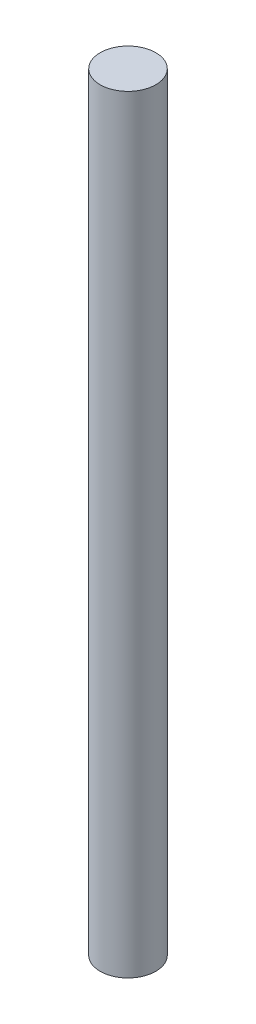
ISO-10303-21;
HEADER;
FILE_DESCRIPTION(('STEP AP214'),'2;1');
FILE_NAME('part.step','',(''),(''),'','','');
FILE_SCHEMA(('AUTOMOTIVE_DESIGN { 1 0 10303 214 1 1 1 1 }'));
ENDSEC;
DATA;
#1=APPLICATION_CONTEXT('core data for automotive mechanical design processes');
#2=APPLICATION_PROTOCOL_DEFINITION('international standard','automotive_design',2000,#1);
#3=PRODUCT_CONTEXT('',#1,'mechanical');
#4=PRODUCT('Part','Part','',(#3));
#5=PRODUCT_RELATED_PRODUCT_CATEGORY('part','',(#4));
#6=PRODUCT_DEFINITION_FORMATION('','',#4);
#7=PRODUCT_DEFINITION_CONTEXT('part definition',#1,'design');
#8=PRODUCT_DEFINITION('design','',#6,#7);
#9=PRODUCT_DEFINITION_SHAPE('','',#8);
#10=(LENGTH_UNIT() NAMED_UNIT(*) SI_UNIT(.MILLI.,.METRE.));
#11=(NAMED_UNIT(*) PLANE_ANGLE_UNIT() SI_UNIT($,.RADIAN.));
#12=(NAMED_UNIT(*) SI_UNIT($,.STERADIAN.) SOLID_ANGLE_UNIT());
#13=UNCERTAINTY_MEASURE_WITH_UNIT(LENGTH_MEASURE(1.E-05),#10,'distance_accuracy_value','');
#14=(GEOMETRIC_REPRESENTATION_CONTEXT(3) GLOBAL_UNCERTAINTY_ASSIGNED_CONTEXT((#13)) GLOBAL_UNIT_ASSIGNED_CONTEXT((#10,
#11,#12)) REPRESENTATION_CONTEXT('',''));
#15=CARTESIAN_POINT('',(0.,0.,0.));
#16=DIRECTION('',(0.,0.,1.));
#17=DIRECTION('',(1.,0.,0.));
#18=AXIS2_PLACEMENT_3D('',#15,#16,#17);
#19=CARTESIAN_POINT('',(0.,221.,0.));
#20=DIRECTION('',(0.,-1.,0.));
#21=DIRECTION('',(0.,0.,-1.));
#22=AXIS2_PLACEMENT_3D('',#19,#20,#21);
#23=CYLINDRICAL_SURFACE('',#22,8.);
#24=CARTESIAN_POINT('',(0.,221.,0.));
#25=DIRECTION('',(0.,1.,0.));
#26=DIRECTION('',(0.,0.,1.));
#27=AXIS2_PLACEMENT_3D('',#24,#25,#26);
#28=CIRCLE('',#27,8.);
#29=CARTESIAN_POINT('',(0.,221.,8.));
#30=VERTEX_POINT('',#29);
#31=EDGE_CURVE('E10',#30,#30,#28,.T.);
#32=ORIENTED_EDGE('',*,*,#31,.F.);
#33=EDGE_LOOP('',(#32));
#34=FACE_BOUND('',#33,.T.);
#35=CARTESIAN_POINT('',(0.,0.,0.));
#36=DIRECTION('',(0.,1.,0.));
#37=DIRECTION('',(0.,0.,1.));
#38=AXIS2_PLACEMENT_3D('',#35,#36,#37);
#39=CIRCLE('',#38,8.);
#40=CARTESIAN_POINT('',(0.,0.,8.));
#41=VERTEX_POINT('',#40);
#42=EDGE_CURVE('E38',#41,#41,#39,.T.);
#43=ORIENTED_EDGE('',*,*,#42,.T.);
#44=EDGE_LOOP('',(#43));
#45=FACE_BOUND('',#44,.T.);
#46=ADVANCED_FACE('F35',(#34,#45),#23,.T.);
#47=CARTESIAN_POINT('',(0.,221.,0.));
#48=DIRECTION('',(0.,1.,0.));
#49=DIRECTION('',(0.,0.,1.));
#50=AXIS2_PLACEMENT_3D('',#47,#48,#49);
#51=PLANE('',#50);
#52=ORIENTED_EDGE('',*,*,#31,.T.);
#53=EDGE_LOOP('',(#52));
#54=FACE_BOUND('',#53,.T.);
#55=ADVANCED_FACE('F50',(#54),#51,.T.);
#56=CARTESIAN_POINT('',(0.,0.,0.));
#57=DIRECTION('',(0.,1.,0.));
#58=DIRECTION('',(0.,0.,1.));
#59=AXIS2_PLACEMENT_3D('',#56,#57,#58);
#60=PLANE('',#59);
#61=ORIENTED_EDGE('',*,*,#42,.F.);
#62=EDGE_LOOP('',(#61));
#63=FACE_BOUND('',#62,.T.);
#64=ADVANCED_FACE('F48',(#63),#60,.F.);
#65=CLOSED_SHELL('',(#46,#55,#64));
#66=MANIFOLD_SOLID_BREP('B2',#65);
#67=ADVANCED_BREP_SHAPE_REPRESENTATION('',(#18,#66),#14);
#68=SHAPE_DEFINITION_REPRESENTATION(#9,#67);
ENDSEC;
END-ISO-10303-21;
